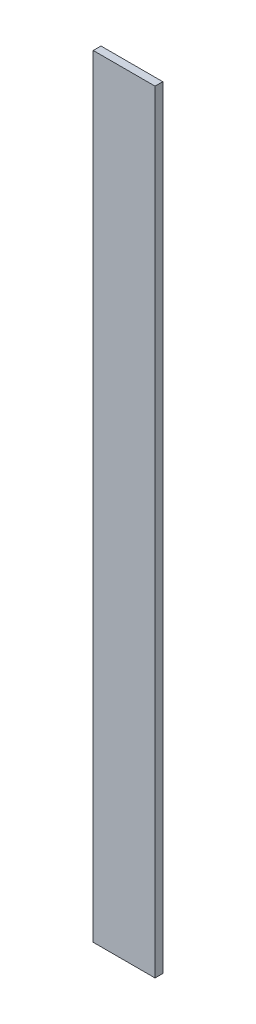
ISO-10303-21;
HEADER;
FILE_DESCRIPTION(('STEP AP214'),'2;1');
FILE_NAME('part.step','',(''),(''),'','','');
FILE_SCHEMA(('AUTOMOTIVE_DESIGN { 1 0 10303 214 1 1 1 1 }'));
ENDSEC;
DATA;
#1=APPLICATION_CONTEXT('core data for automotive mechanical design processes');
#2=APPLICATION_PROTOCOL_DEFINITION('international standard','automotive_design',2000,#1);
#3=PRODUCT_CONTEXT('',#1,'mechanical');
#4=PRODUCT('Part','Part','',(#3));
#5=PRODUCT_RELATED_PRODUCT_CATEGORY('part','',(#4));
#6=PRODUCT_DEFINITION_FORMATION('','',#4);
#7=PRODUCT_DEFINITION_CONTEXT('part definition',#1,'design');
#8=PRODUCT_DEFINITION('design','',#6,#7);
#9=PRODUCT_DEFINITION_SHAPE('','',#8);
#10=(LENGTH_UNIT() NAMED_UNIT(*) SI_UNIT(.MILLI.,.METRE.));
#11=(NAMED_UNIT(*) PLANE_ANGLE_UNIT() SI_UNIT($,.RADIAN.));
#12=(NAMED_UNIT(*) SI_UNIT($,.STERADIAN.) SOLID_ANGLE_UNIT());
#13=UNCERTAINTY_MEASURE_WITH_UNIT(LENGTH_MEASURE(1.E-05),#10,'distance_accuracy_value','');
#14=(GEOMETRIC_REPRESENTATION_CONTEXT(3) GLOBAL_UNCERTAINTY_ASSIGNED_CONTEXT((#13)) GLOBAL_UNIT_ASSIGNED_CONTEXT((#10,
#11,#12)) REPRESENTATION_CONTEXT('',''));
#15=CARTESIAN_POINT('',(0.,0.,0.));
#16=DIRECTION('',(0.,0.,1.));
#17=DIRECTION('',(1.,0.,0.));
#18=AXIS2_PLACEMENT_3D('',#15,#16,#17);
#19=CARTESIAN_POINT('',(0.,317.5,0.));
#20=DIRECTION('',(1.,0.,0.));
#21=DIRECTION('',(0.,0.,-1.));
#22=AXIS2_PLACEMENT_3D('',#19,#20,#21);
#23=PLANE('',#22);
#24=DIRECTION('',(0.,0.,1.));
#25=VECTOR('',#24,1.);
#26=CARTESIAN_POINT('',(0.,-317.5,0.));
#27=LINE('',#26,#25);
#28=CARTESIAN_POINT('',(0.,-317.5,0.));
#29=VERTEX_POINT('',#28);
#30=CARTESIAN_POINT('',(0.,-317.5,6.35));
#31=VERTEX_POINT('',#30);
#32=EDGE_CURVE('E98',#29,#31,#27,.T.);
#33=ORIENTED_EDGE('',*,*,#32,.T.);
#34=DIRECTION('',(0.,-1.,0.));
#35=VECTOR('',#34,1.);
#36=CARTESIAN_POINT('',(0.,317.5,6.35));
#37=LINE('',#36,#35);
#38=CARTESIAN_POINT('',(0.,317.5,6.35));
#39=VERTEX_POINT('',#38);
#40=EDGE_CURVE('E11',#39,#31,#37,.T.);
#41=ORIENTED_EDGE('',*,*,#40,.F.);
#42=DIRECTION('',(0.,0.,1.));
#43=VECTOR('',#42,1.);
#44=CARTESIAN_POINT('',(0.,317.5,0.));
#45=LINE('',#44,#43);
#46=CARTESIAN_POINT('',(0.,317.5,0.));
#47=VERTEX_POINT('',#46);
#48=EDGE_CURVE('E86',#47,#39,#45,.T.);
#49=ORIENTED_EDGE('',*,*,#48,.F.);
#50=DIRECTION('',(0.,-1.,0.));
#51=VECTOR('',#50,1.);
#52=CARTESIAN_POINT('',(0.,317.5,0.));
#53=LINE('',#52,#51);
#54=EDGE_CURVE('E94',#47,#29,#53,.T.);
#55=ORIENTED_EDGE('',*,*,#54,.T.);
#56=EDGE_LOOP('',(#33,#41,#49,#55));
#57=FACE_BOUND('',#56,.T.);
#58=ADVANCED_FACE('F35',(#57),#23,.F.);
#59=CARTESIAN_POINT('',(0.,317.5,6.35));
#60=DIRECTION('',(0.,0.,-1.));
#61=DIRECTION('',(-1.,0.,0.));
#62=AXIS2_PLACEMENT_3D('',#59,#60,#61);
#63=PLANE('',#62);
#64=DIRECTION('',(1.,0.,0.));
#65=VECTOR('',#64,1.);
#66=CARTESIAN_POINT('',(0.,-317.5,6.35));
#67=LINE('',#66,#65);
#68=CARTESIAN_POINT('',(50.8,-317.5,6.35));
#69=VERTEX_POINT('',#68);
#70=EDGE_CURVE('E90',#31,#69,#67,.T.);
#71=ORIENTED_EDGE('',*,*,#70,.T.);
#72=DIRECTION('',(0.,-1.,0.));
#73=VECTOR('',#72,1.);
#74=CARTESIAN_POINT('',(50.8,317.5,6.35));
#75=LINE('',#74,#73);
#76=CARTESIAN_POINT('',(50.8,317.5,6.35));
#77=VERTEX_POINT('',#76);
#78=EDGE_CURVE('E43',#77,#69,#75,.T.);
#79=ORIENTED_EDGE('',*,*,#78,.F.);
#80=DIRECTION('',(1.,0.,0.));
#81=VECTOR('',#80,1.);
#82=CARTESIAN_POINT('',(0.,317.5,6.35));
#83=LINE('',#82,#81);
#84=EDGE_CURVE('E81',#39,#77,#83,.T.);
#85=ORIENTED_EDGE('',*,*,#84,.F.);
#86=ORIENTED_EDGE('',*,*,#40,.T.);
#87=EDGE_LOOP('',(#71,#79,#85,#86));
#88=FACE_BOUND('',#87,.T.);
#89=ADVANCED_FACE('F89',(#88),#63,.F.);
#90=CARTESIAN_POINT('',(50.8,317.5,0.));
#91=DIRECTION('',(-1.,0.,0.));
#92=DIRECTION('',(0.,0.,1.));
#93=AXIS2_PLACEMENT_3D('',#90,#91,#92);
#94=PLANE('',#93);
#95=DIRECTION('',(0.,0.,-1.));
#96=VECTOR('',#95,1.);
#97=CARTESIAN_POINT('',(50.8,-317.5,0.));
#98=LINE('',#97,#96);
#99=CARTESIAN_POINT('',(50.8,-317.5,0.));
#100=VERTEX_POINT('',#99);
#101=EDGE_CURVE('E68',#69,#100,#98,.T.);
#102=ORIENTED_EDGE('',*,*,#101,.T.);
#103=DIRECTION('',(0.,-1.,0.));
#104=VECTOR('',#103,1.);
#105=CARTESIAN_POINT('',(50.8,317.5,0.));
#106=LINE('',#105,#104);
#107=CARTESIAN_POINT('',(50.8,317.5,0.));
#108=VERTEX_POINT('',#107);
#109=EDGE_CURVE('E91',#108,#100,#106,.T.);
#110=ORIENTED_EDGE('',*,*,#109,.F.);
#111=DIRECTION('',(0.,0.,-1.));
#112=VECTOR('',#111,1.);
#113=CARTESIAN_POINT('',(50.8,317.5,0.));
#114=LINE('',#113,#112);
#115=EDGE_CURVE('E84',#77,#108,#114,.T.);
#116=ORIENTED_EDGE('',*,*,#115,.F.);
#117=ORIENTED_EDGE('',*,*,#78,.T.);
#118=EDGE_LOOP('',(#102,#110,#116,#117));
#119=FACE_BOUND('',#118,.T.);
#120=ADVANCED_FACE('F92',(#119),#94,.F.);
#121=CARTESIAN_POINT('',(0.,317.5,0.));
#122=DIRECTION('',(0.,0.,1.));
#123=DIRECTION('',(1.,0.,0.));
#124=AXIS2_PLACEMENT_3D('',#121,#122,#123);
#125=PLANE('',#124);
#126=DIRECTION('',(-1.,0.,0.));
#127=VECTOR('',#126,1.);
#128=CARTESIAN_POINT('',(0.,-317.5,0.));
#129=LINE('',#128,#127);
#130=EDGE_CURVE('E74',#100,#29,#129,.T.);
#131=ORIENTED_EDGE('',*,*,#130,.T.);
#132=ORIENTED_EDGE('',*,*,#54,.F.);
#133=DIRECTION('',(-1.,0.,0.));
#134=VECTOR('',#133,1.);
#135=CARTESIAN_POINT('',(0.,317.5,0.));
#136=LINE('',#135,#134);
#137=EDGE_CURVE('E51',#108,#47,#136,.T.);
#138=ORIENTED_EDGE('',*,*,#137,.F.);
#139=ORIENTED_EDGE('',*,*,#109,.T.);
#140=EDGE_LOOP('',(#131,#132,#138,#139));
#141=FACE_BOUND('',#140,.T.);
#142=ADVANCED_FACE('F105',(#141),#125,.F.);
#143=CARTESIAN_POINT('',(0.,317.5,6.35));
#144=DIRECTION('',(0.,1.,0.));
#145=DIRECTION('',(0.,0.,1.));
#146=AXIS2_PLACEMENT_3D('',#143,#144,#145);
#147=PLANE('',#146);
#148=ORIENTED_EDGE('',*,*,#48,.T.);
#149=ORIENTED_EDGE('',*,*,#84,.T.);
#150=ORIENTED_EDGE('',*,*,#115,.T.);
#151=ORIENTED_EDGE('',*,*,#137,.T.);
#152=EDGE_LOOP('',(#148,#149,#150,#151));
#153=FACE_BOUND('',#152,.T.);
#154=ADVANCED_FACE('F82',(#153),#147,.T.);
#155=CARTESIAN_POINT('',(0.,-317.5,6.35));
#156=DIRECTION('',(0.,1.,0.));
#157=DIRECTION('',(0.,0.,1.));
#158=AXIS2_PLACEMENT_3D('',#155,#156,#157);
#159=PLANE('',#158);
#160=ORIENTED_EDGE('',*,*,#32,.F.);
#161=ORIENTED_EDGE('',*,*,#130,.F.);
#162=ORIENTED_EDGE('',*,*,#101,.F.);
#163=ORIENTED_EDGE('',*,*,#70,.F.);
#164=EDGE_LOOP('',(#160,#161,#162,#163));
#165=FACE_BOUND('',#164,.T.);
#166=ADVANCED_FACE('F108',(#165),#159,.F.);
#167=CLOSED_SHELL('',(#58,#89,#120,#142,#154,#166));
#168=MANIFOLD_SOLID_BREP('B2',#167);
#169=ADVANCED_BREP_SHAPE_REPRESENTATION('',(#18,#168),#14);
#170=SHAPE_DEFINITION_REPRESENTATION(#9,#169);
ENDSEC;
END-ISO-10303-21;
